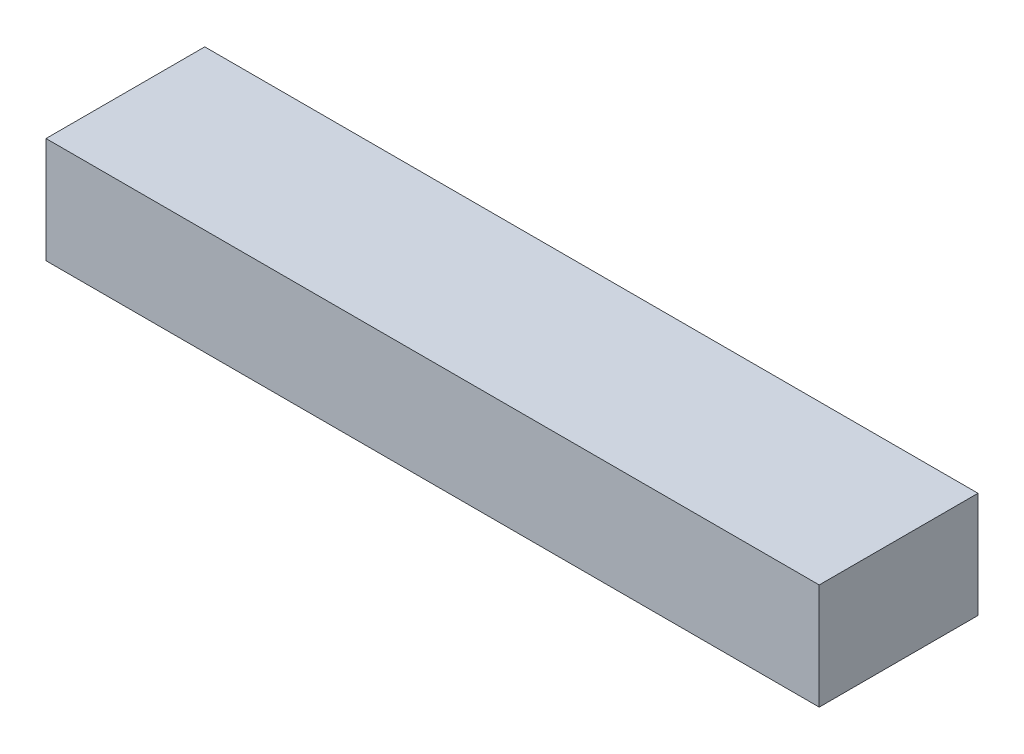
ISO-10303-21;
HEADER;
FILE_DESCRIPTION(('STEP AP214'),'2;1');
FILE_NAME('part.step','',(''),(''),'','','');
FILE_SCHEMA(('AUTOMOTIVE_DESIGN { 1 0 10303 214 1 1 1 1 }'));
ENDSEC;
DATA;
#1=APPLICATION_CONTEXT('core data for automotive mechanical design processes');
#2=APPLICATION_PROTOCOL_DEFINITION('international standard','automotive_design',2000,#1);
#3=PRODUCT_CONTEXT('',#1,'mechanical');
#4=PRODUCT('Part','Part','',(#3));
#5=PRODUCT_RELATED_PRODUCT_CATEGORY('part','',(#4));
#6=PRODUCT_DEFINITION_FORMATION('','',#4);
#7=PRODUCT_DEFINITION_CONTEXT('part definition',#1,'design');
#8=PRODUCT_DEFINITION('design','',#6,#7);
#9=PRODUCT_DEFINITION_SHAPE('','',#8);
#10=(LENGTH_UNIT() NAMED_UNIT(*) SI_UNIT(.MILLI.,.METRE.));
#11=(NAMED_UNIT(*) PLANE_ANGLE_UNIT() SI_UNIT($,.RADIAN.));
#12=(NAMED_UNIT(*) SI_UNIT($,.STERADIAN.) SOLID_ANGLE_UNIT());
#13=UNCERTAINTY_MEASURE_WITH_UNIT(LENGTH_MEASURE(1.E-05),#10,'distance_accuracy_value','');
#14=(GEOMETRIC_REPRESENTATION_CONTEXT(3) GLOBAL_UNCERTAINTY_ASSIGNED_CONTEXT((#13)) GLOBAL_UNIT_ASSIGNED_CONTEXT((#10,
#11,#12)) REPRESENTATION_CONTEXT('',''));
#15=CARTESIAN_POINT('',(0.,0.,0.));
#16=DIRECTION('',(0.,0.,1.));
#17=DIRECTION('',(1.,0.,0.));
#18=AXIS2_PLACEMENT_3D('',#15,#16,#17);
#19=CARTESIAN_POINT('',(-34.2078469926773,10.,-24.1629452319337));
#20=DIRECTION('',(1.,0.,0.));
#21=DIRECTION('',(0.,0.,-1.));
#22=AXIS2_PLACEMENT_3D('',#19,#20,#21);
#23=PLANE('',#22);
#24=DIRECTION('',(0.,0.,1.));
#25=VECTOR('',#24,1.);
#26=CARTESIAN_POINT('',(-34.2078469926773,0.,-24.1629452319337));
#27=LINE('',#26,#25);
#28=CARTESIAN_POINT('',(-34.2078469926773,0.,-39.1629452319337));
#29=VERTEX_POINT('',#28);
#30=CARTESIAN_POINT('',(-34.2078469926773,0.,-24.1629452319337));
#31=VERTEX_POINT('',#30);
#32=EDGE_CURVE('E98',#29,#31,#27,.T.);
#33=ORIENTED_EDGE('',*,*,#32,.T.);
#34=DIRECTION('',(0.,-1.,0.));
#35=VECTOR('',#34,1.);
#36=CARTESIAN_POINT('',(-34.2078469926773,10.,-24.1629452319337));
#37=LINE('',#36,#35);
#38=CARTESIAN_POINT('',(-34.2078469926773,10.,-24.1629452319337));
#39=VERTEX_POINT('',#38);
#40=EDGE_CURVE('E11',#39,#31,#37,.T.);
#41=ORIENTED_EDGE('',*,*,#40,.F.);
#42=DIRECTION('',(0.,0.,1.));
#43=VECTOR('',#42,1.);
#44=CARTESIAN_POINT('',(-34.2078469926773,10.,-24.1629452319337));
#45=LINE('',#44,#43);
#46=CARTESIAN_POINT('',(-34.2078469926773,10.,-39.1629452319337));
#47=VERTEX_POINT('',#46);
#48=EDGE_CURVE('E86',#47,#39,#45,.T.);
#49=ORIENTED_EDGE('',*,*,#48,.F.);
#50=DIRECTION('',(0.,-1.,0.));
#51=VECTOR('',#50,1.);
#52=CARTESIAN_POINT('',(-34.2078469926773,10.,-39.1629452319337));
#53=LINE('',#52,#51);
#54=EDGE_CURVE('E94',#47,#29,#53,.T.);
#55=ORIENTED_EDGE('',*,*,#54,.T.);
#56=EDGE_LOOP('',(#33,#41,#49,#55));
#57=FACE_BOUND('',#56,.T.);
#58=ADVANCED_FACE('F35',(#57),#23,.F.);
#59=CARTESIAN_POINT('',(-34.2078469926773,10.,-24.1629452319337));
#60=DIRECTION('',(0.,0.,-1.));
#61=DIRECTION('',(-1.,0.,0.));
#62=AXIS2_PLACEMENT_3D('',#59,#60,#61);
#63=PLANE('',#62);
#64=DIRECTION('',(1.,0.,0.));
#65=VECTOR('',#64,1.);
#66=CARTESIAN_POINT('',(-34.2078469926773,0.,-24.1629452319337));
#67=LINE('',#66,#65);
#68=CARTESIAN_POINT('',(38.8421530073227,0.,-24.1629452319337));
#69=VERTEX_POINT('',#68);
#70=EDGE_CURVE('E90',#31,#69,#67,.T.);
#71=ORIENTED_EDGE('',*,*,#70,.T.);
#72=DIRECTION('',(0.,-1.,0.));
#73=VECTOR('',#72,1.);
#74=CARTESIAN_POINT('',(38.8421530073227,10.,-24.1629452319337));
#75=LINE('',#74,#73);
#76=CARTESIAN_POINT('',(38.8421530073227,10.,-24.1629452319337));
#77=VERTEX_POINT('',#76);
#78=EDGE_CURVE('E43',#77,#69,#75,.T.);
#79=ORIENTED_EDGE('',*,*,#78,.F.);
#80=DIRECTION('',(1.,0.,0.));
#81=VECTOR('',#80,1.);
#82=CARTESIAN_POINT('',(-34.2078469926773,10.,-24.1629452319337));
#83=LINE('',#82,#81);
#84=EDGE_CURVE('E81',#39,#77,#83,.T.);
#85=ORIENTED_EDGE('',*,*,#84,.F.);
#86=ORIENTED_EDGE('',*,*,#40,.T.);
#87=EDGE_LOOP('',(#71,#79,#85,#86));
#88=FACE_BOUND('',#87,.T.);
#89=ADVANCED_FACE('F89',(#88),#63,.F.);
#90=CARTESIAN_POINT('',(38.8421530073227,10.,-24.1629452319337));
#91=DIRECTION('',(-1.,0.,0.));
#92=DIRECTION('',(0.,0.,1.));
#93=AXIS2_PLACEMENT_3D('',#90,#91,#92);
#94=PLANE('',#93);
#95=DIRECTION('',(0.,0.,-1.));
#96=VECTOR('',#95,1.);
#97=CARTESIAN_POINT('',(38.8421530073227,0.,-24.1629452319337));
#98=LINE('',#97,#96);
#99=CARTESIAN_POINT('',(38.8421530073227,0.,-39.1629452319337));
#100=VERTEX_POINT('',#99);
#101=EDGE_CURVE('E68',#69,#100,#98,.T.);
#102=ORIENTED_EDGE('',*,*,#101,.T.);
#103=DIRECTION('',(0.,-1.,0.));
#104=VECTOR('',#103,1.);
#105=CARTESIAN_POINT('',(38.8421530073227,10.,-39.1629452319337));
#106=LINE('',#105,#104);
#107=CARTESIAN_POINT('',(38.8421530073227,10.,-39.1629452319337));
#108=VERTEX_POINT('',#107);
#109=EDGE_CURVE('E91',#108,#100,#106,.T.);
#110=ORIENTED_EDGE('',*,*,#109,.F.);
#111=DIRECTION('',(0.,0.,-1.));
#112=VECTOR('',#111,1.);
#113=CARTESIAN_POINT('',(38.8421530073227,10.,-24.1629452319337));
#114=LINE('',#113,#112);
#115=EDGE_CURVE('E84',#77,#108,#114,.T.);
#116=ORIENTED_EDGE('',*,*,#115,.F.);
#117=ORIENTED_EDGE('',*,*,#78,.T.);
#118=EDGE_LOOP('',(#102,#110,#116,#117));
#119=FACE_BOUND('',#118,.T.);
#120=ADVANCED_FACE('F92',(#119),#94,.F.);
#121=CARTESIAN_POINT('',(-34.2078469926773,10.,-39.1629452319337));
#122=DIRECTION('',(0.,0.,1.));
#123=DIRECTION('',(1.,0.,0.));
#124=AXIS2_PLACEMENT_3D('',#121,#122,#123);
#125=PLANE('',#124);
#126=DIRECTION('',(-1.,0.,0.));
#127=VECTOR('',#126,1.);
#128=CARTESIAN_POINT('',(-34.2078469926773,0.,-39.1629452319337));
#129=LINE('',#128,#127);
#130=EDGE_CURVE('E74',#100,#29,#129,.T.);
#131=ORIENTED_EDGE('',*,*,#130,.T.);
#132=ORIENTED_EDGE('',*,*,#54,.F.);
#133=DIRECTION('',(-1.,0.,0.));
#134=VECTOR('',#133,1.);
#135=CARTESIAN_POINT('',(-34.2078469926773,10.,-39.1629452319337));
#136=LINE('',#135,#134);
#137=EDGE_CURVE('E51',#108,#47,#136,.T.);
#138=ORIENTED_EDGE('',*,*,#137,.F.);
#139=ORIENTED_EDGE('',*,*,#109,.T.);
#140=EDGE_LOOP('',(#131,#132,#138,#139));
#141=FACE_BOUND('',#140,.T.);
#142=ADVANCED_FACE('F105',(#141),#125,.F.);
#143=CARTESIAN_POINT('',(0.,10.,0.));
#144=DIRECTION('',(0.,-1.,0.));
#145=DIRECTION('',(0.,0.,-1.));
#146=AXIS2_PLACEMENT_3D('',#143,#144,#145);
#147=PLANE('',#146);
#148=ORIENTED_EDGE('',*,*,#48,.T.);
#149=ORIENTED_EDGE('',*,*,#84,.T.);
#150=ORIENTED_EDGE('',*,*,#115,.T.);
#151=ORIENTED_EDGE('',*,*,#137,.T.);
#152=EDGE_LOOP('',(#148,#149,#150,#151));
#153=FACE_BOUND('',#152,.T.);
#154=ADVANCED_FACE('F82',(#153),#147,.F.);
#155=CARTESIAN_POINT('',(0.,0.,0.));
#156=DIRECTION('',(0.,-1.,0.));
#157=DIRECTION('',(0.,0.,-1.));
#158=AXIS2_PLACEMENT_3D('',#155,#156,#157);
#159=PLANE('',#158);
#160=ORIENTED_EDGE('',*,*,#32,.F.);
#161=ORIENTED_EDGE('',*,*,#130,.F.);
#162=ORIENTED_EDGE('',*,*,#101,.F.);
#163=ORIENTED_EDGE('',*,*,#70,.F.);
#164=EDGE_LOOP('',(#160,#161,#162,#163));
#165=FACE_BOUND('',#164,.T.);
#166=ADVANCED_FACE('F108',(#165),#159,.T.);
#167=CLOSED_SHELL('',(#58,#89,#120,#142,#154,#166));
#168=MANIFOLD_SOLID_BREP('B2',#167);
#169=ADVANCED_BREP_SHAPE_REPRESENTATION('',(#18,#168),#14);
#170=SHAPE_DEFINITION_REPRESENTATION(#9,#169);
ENDSEC;
END-ISO-10303-21;
